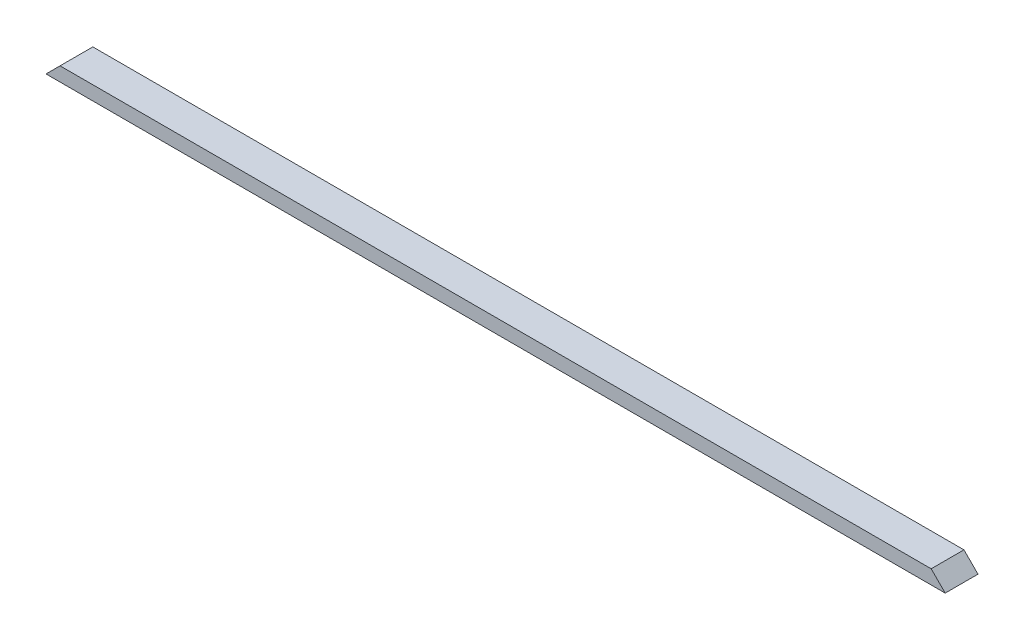
ISO-10303-21;
HEADER;
FILE_DESCRIPTION(('STEP AP214'),'2;1');
FILE_NAME('part.step','',(''),(''),'','','');
FILE_SCHEMA(('AUTOMOTIVE_DESIGN { 1 0 10303 214 1 1 1 1 }'));
ENDSEC;
DATA;
#1=APPLICATION_CONTEXT('core data for automotive mechanical design processes');
#2=APPLICATION_PROTOCOL_DEFINITION('international standard','automotive_design',2000,#1);
#3=PRODUCT_CONTEXT('',#1,'mechanical');
#4=PRODUCT('Part','Part','',(#3));
#5=PRODUCT_RELATED_PRODUCT_CATEGORY('part','',(#4));
#6=PRODUCT_DEFINITION_FORMATION('','',#4);
#7=PRODUCT_DEFINITION_CONTEXT('part definition',#1,'design');
#8=PRODUCT_DEFINITION('design','',#6,#7);
#9=PRODUCT_DEFINITION_SHAPE('','',#8);
#10=(LENGTH_UNIT() NAMED_UNIT(*) SI_UNIT(.MILLI.,.METRE.));
#11=(NAMED_UNIT(*) PLANE_ANGLE_UNIT() SI_UNIT($,.RADIAN.));
#12=(NAMED_UNIT(*) SI_UNIT($,.STERADIAN.) SOLID_ANGLE_UNIT());
#13=UNCERTAINTY_MEASURE_WITH_UNIT(LENGTH_MEASURE(1.E-05),#10,'distance_accuracy_value','');
#14=(GEOMETRIC_REPRESENTATION_CONTEXT(3) GLOBAL_UNCERTAINTY_ASSIGNED_CONTEXT((#13)) GLOBAL_UNIT_ASSIGNED_CONTEXT((#10,
#11,#12)) REPRESENTATION_CONTEXT('',''));
#15=CARTESIAN_POINT('',(0.,0.,0.));
#16=DIRECTION('',(0.,0.,1.));
#17=DIRECTION('',(1.,0.,0.));
#18=AXIS2_PLACEMENT_3D('',#15,#16,#17);
#19=CARTESIAN_POINT('',(0.,38.1,0.));
#20=DIRECTION('',(0.,0.,-1.));
#21=DIRECTION('',(-1.,0.,0.));
#22=AXIS2_PLACEMENT_3D('',#19,#20,#21);
#23=PLANE('',#22);
#24=DIRECTION('',(1.,0.,0.));
#25=VECTOR('',#24,1.);
#26=CARTESIAN_POINT('',(0.,38.1,0.));
#27=LINE('',#26,#25);
#28=CARTESIAN_POINT('',(38.1,38.1,0.));
#29=VERTEX_POINT('',#28);
#30=CARTESIAN_POINT('',(2400.3,38.1,0.));
#31=VERTEX_POINT('',#30);
#32=EDGE_CURVE('E51',#29,#31,#27,.T.);
#33=ORIENTED_EDGE('',*,*,#32,.F.);
#34=DIRECTION('',(0.707106781186547,0.707106781186547,0.));
#35=VECTOR('',#34,1.);
#36=CARTESIAN_POINT('',(0.,0.,0.));
#37=LINE('',#36,#35);
#38=CARTESIAN_POINT('',(0.,0.,0.));
#39=VERTEX_POINT('',#38);
#40=EDGE_CURVE('E86',#39,#29,#37,.T.);
#41=ORIENTED_EDGE('',*,*,#40,.F.);
#42=DIRECTION('',(1.,0.,0.));
#43=VECTOR('',#42,1.);
#44=CARTESIAN_POINT('',(0.,0.,0.));
#45=LINE('',#44,#43);
#46=CARTESIAN_POINT('',(2438.4,0.,0.));
#47=VERTEX_POINT('',#46);
#48=EDGE_CURVE('E92',#39,#47,#45,.T.);
#49=ORIENTED_EDGE('',*,*,#48,.T.);
#50=DIRECTION('',(0.707106781186548,-0.707106781186547,0.));
#51=VECTOR('',#50,1.);
#52=CARTESIAN_POINT('',(2400.3,38.1,0.));
#53=LINE('',#52,#51);
#54=EDGE_CURVE('E67',#31,#47,#53,.T.);
#55=ORIENTED_EDGE('',*,*,#54,.F.);
#56=EDGE_LOOP('',(#33,#41,#49,#55));
#57=FACE_BOUND('',#56,.T.);
#58=ADVANCED_FACE('F42',(#57),#23,.F.);
#59=CARTESIAN_POINT('',(0.,38.1,-88.9));
#60=DIRECTION('',(0.,0.,1.));
#61=DIRECTION('',(1.,0.,0.));
#62=AXIS2_PLACEMENT_3D('',#59,#60,#61);
#63=PLANE('',#62);
#64=DIRECTION('',(-1.,0.,0.));
#65=VECTOR('',#64,1.);
#66=CARTESIAN_POINT('',(0.,0.,-88.9));
#67=LINE('',#66,#65);
#68=CARTESIAN_POINT('',(2438.4,0.,-88.9));
#69=VERTEX_POINT('',#68);
#70=CARTESIAN_POINT('',(0.,0.,-88.9));
#71=VERTEX_POINT('',#70);
#72=EDGE_CURVE('E45',#69,#71,#67,.T.);
#73=ORIENTED_EDGE('',*,*,#72,.T.);
#74=DIRECTION('',(0.707106781186547,0.707106781186547,0.));
#75=VECTOR('',#74,1.);
#76=CARTESIAN_POINT('',(0.,0.,-88.9));
#77=LINE('',#76,#75);
#78=CARTESIAN_POINT('',(38.1,38.1,-88.9));
#79=VERTEX_POINT('',#78);
#80=EDGE_CURVE('E59',#71,#79,#77,.T.);
#81=ORIENTED_EDGE('',*,*,#80,.T.);
#82=DIRECTION('',(-1.,0.,0.));
#83=VECTOR('',#82,1.);
#84=CARTESIAN_POINT('',(0.,38.1,-88.9));
#85=LINE('',#84,#83);
#86=CARTESIAN_POINT('',(2400.3,38.1,-88.9));
#87=VERTEX_POINT('',#86);
#88=EDGE_CURVE('E11',#87,#79,#85,.T.);
#89=ORIENTED_EDGE('',*,*,#88,.F.);
#90=DIRECTION('',(0.707106781186548,-0.707106781186547,0.));
#91=VECTOR('',#90,1.);
#92=CARTESIAN_POINT('',(2400.3,38.1,-88.9));
#93=LINE('',#92,#91);
#94=EDGE_CURVE('E110',#87,#69,#93,.T.);
#95=ORIENTED_EDGE('',*,*,#94,.T.);
#96=EDGE_LOOP('',(#73,#81,#89,#95));
#97=FACE_BOUND('',#96,.T.);
#98=ADVANCED_FACE('F125',(#97),#63,.F.);
#99=CARTESIAN_POINT('',(0.,38.1,0.));
#100=DIRECTION('',(0.,-1.,0.));
#101=DIRECTION('',(0.,0.,-1.));
#102=AXIS2_PLACEMENT_3D('',#99,#100,#101);
#103=PLANE('',#102);
#104=ORIENTED_EDGE('',*,*,#88,.T.);
#105=DIRECTION('',(0.,0.,1.));
#106=VECTOR('',#105,1.);
#107=CARTESIAN_POINT('',(38.1,38.1,-88.9));
#108=LINE('',#107,#106);
#109=EDGE_CURVE('E93',#79,#29,#108,.T.);
#110=ORIENTED_EDGE('',*,*,#109,.T.);
#111=ORIENTED_EDGE('',*,*,#32,.T.);
#112=DIRECTION('',(0.,0.,1.));
#113=VECTOR('',#112,1.);
#114=CARTESIAN_POINT('',(2400.3,38.1,-88.9));
#115=LINE('',#114,#113);
#116=EDGE_CURVE('E114',#87,#31,#115,.T.);
#117=ORIENTED_EDGE('',*,*,#116,.F.);
#118=EDGE_LOOP('',(#104,#110,#111,#117));
#119=FACE_BOUND('',#118,.T.);
#120=ADVANCED_FACE('F128',(#119),#103,.F.);
#121=CARTESIAN_POINT('',(0.,0.,0.));
#122=DIRECTION('',(0.,-1.,0.));
#123=DIRECTION('',(0.,0.,-1.));
#124=AXIS2_PLACEMENT_3D('',#121,#122,#123);
#125=PLANE('',#124);
#126=DIRECTION('',(0.,0.,1.));
#127=VECTOR('',#126,1.);
#128=CARTESIAN_POINT('',(0.,0.,0.));
#129=LINE('',#128,#127);
#130=EDGE_CURVE('E83',#71,#39,#129,.T.);
#131=ORIENTED_EDGE('',*,*,#130,.F.);
#132=ORIENTED_EDGE('',*,*,#72,.F.);
#133=DIRECTION('',(0.,0.,-1.));
#134=VECTOR('',#133,1.);
#135=CARTESIAN_POINT('',(2438.4,0.,0.));
#136=LINE('',#135,#134);
#137=EDGE_CURVE('E102',#47,#69,#136,.T.);
#138=ORIENTED_EDGE('',*,*,#137,.F.);
#139=ORIENTED_EDGE('',*,*,#48,.F.);
#140=EDGE_LOOP('',(#131,#132,#138,#139));
#141=FACE_BOUND('',#140,.T.);
#142=ADVANCED_FACE('F101',(#141),#125,.T.);
#143=CARTESIAN_POINT('',(2400.3,38.1,-88.9));
#144=DIRECTION('',(-0.707106781186547,-0.707106781186548,0.));
#145=DIRECTION('',(0.707106781186548,-0.707106781186547,0.));
#146=AXIS2_PLACEMENT_3D('',#143,#144,#145);
#147=PLANE('',#146);
#148=ORIENTED_EDGE('',*,*,#54,.T.);
#149=ORIENTED_EDGE('',*,*,#137,.T.);
#150=ORIENTED_EDGE('',*,*,#94,.F.);
#151=ORIENTED_EDGE('',*,*,#116,.T.);
#152=EDGE_LOOP('',(#148,#149,#150,#151));
#153=FACE_BOUND('',#152,.T.);
#154=ADVANCED_FACE('F129',(#153),#147,.F.);
#155=CARTESIAN_POINT('',(0.,0.,-88.9));
#156=DIRECTION('',(0.707106781186547,-0.707106781186547,0.));
#157=DIRECTION('',(0.707106781186548,0.707106781186548,0.));
#158=AXIS2_PLACEMENT_3D('',#155,#156,#157);
#159=PLANE('',#158);
#160=ORIENTED_EDGE('',*,*,#40,.T.);
#161=ORIENTED_EDGE('',*,*,#109,.F.);
#162=ORIENTED_EDGE('',*,*,#80,.F.);
#163=ORIENTED_EDGE('',*,*,#130,.T.);
#164=EDGE_LOOP('',(#160,#161,#162,#163));
#165=FACE_BOUND('',#164,.T.);
#166=ADVANCED_FACE('F85',(#165),#159,.F.);
#167=CLOSED_SHELL('',(#58,#98,#120,#142,#154,#166));
#168=MANIFOLD_SOLID_BREP('B2',#167);
#169=ADVANCED_BREP_SHAPE_REPRESENTATION('',(#18,#168),#14);
#170=SHAPE_DEFINITION_REPRESENTATION(#9,#169);
ENDSEC;
END-ISO-10303-21;
